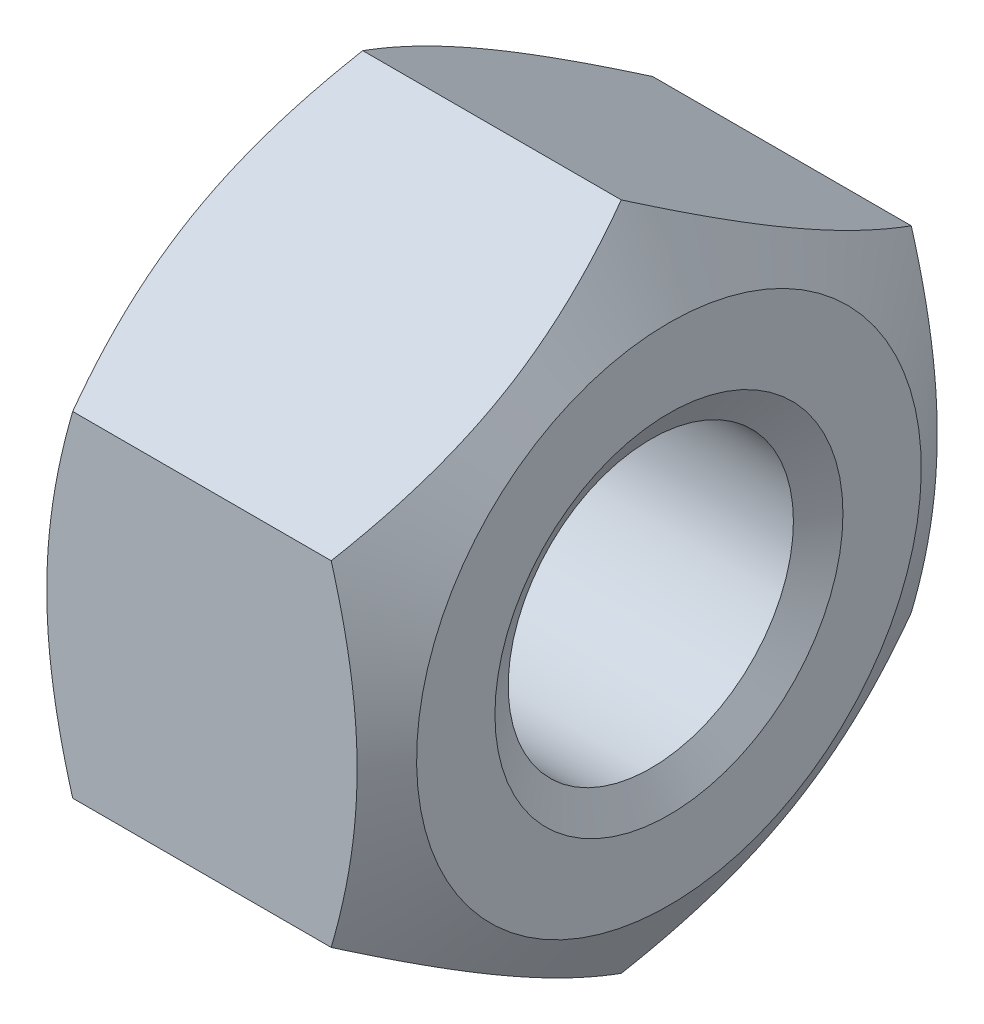
ISO-10303-21;
HEADER;
FILE_DESCRIPTION(('STEP AP214'),'2;1');
FILE_NAME('part.step','',(''),(''),'','','');
FILE_SCHEMA(('AUTOMOTIVE_DESIGN { 1 0 10303 214 1 1 1 1 }'));
ENDSEC;
DATA;
#1=APPLICATION_CONTEXT('core data for automotive mechanical design processes');
#2=APPLICATION_PROTOCOL_DEFINITION('international standard','automotive_design',2000,#1);
#3=PRODUCT_CONTEXT('',#1,'mechanical');
#4=PRODUCT('Part','Part','',(#3));
#5=PRODUCT_RELATED_PRODUCT_CATEGORY('part','',(#4));
#6=PRODUCT_DEFINITION_FORMATION('','',#4);
#7=PRODUCT_DEFINITION_CONTEXT('part definition',#1,'design');
#8=PRODUCT_DEFINITION('design','',#6,#7);
#9=PRODUCT_DEFINITION_SHAPE('','',#8);
#10=(LENGTH_UNIT() NAMED_UNIT(*) SI_UNIT(.MILLI.,.METRE.));
#11=(NAMED_UNIT(*) PLANE_ANGLE_UNIT() SI_UNIT($,.RADIAN.));
#12=(NAMED_UNIT(*) SI_UNIT($,.STERADIAN.) SOLID_ANGLE_UNIT());
#13=UNCERTAINTY_MEASURE_WITH_UNIT(LENGTH_MEASURE(1.E-05),#10,'distance_accuracy_value','');
#14=(GEOMETRIC_REPRESENTATION_CONTEXT(3) GLOBAL_UNCERTAINTY_ASSIGNED_CONTEXT((#13)) GLOBAL_UNIT_ASSIGNED_CONTEXT((#10,
#11,#12)) REPRESENTATION_CONTEXT('',''));
#15=CARTESIAN_POINT('',(0.,0.,0.));
#16=DIRECTION('',(0.,0.,1.));
#17=DIRECTION('',(1.,0.,0.));
#18=AXIS2_PLACEMENT_3D('',#15,#16,#17);
#19=CARTESIAN_POINT('',(0.,-5.77350269189626,0.));
#20=DIRECTION('',(0.,-0.866025403784439,0.5));
#21=DIRECTION('',(-1.,0.,0.));
#22=AXIS2_PLACEMENT_3D('',#19,#20,#21);
#23=PLANE('',#22);
#24=CARTESIAN_POINT('',(0.82185966235846,-2.88675134594813,5.));
#25=CARTESIAN_POINT('',(-0.0114736709748725,-4.3301270189222,2.5));
#26=CARTESIAN_POINT('',(0.821859662358461,-5.77350269189626,0.));
#27=(BOUNDED_CURVE() B_SPLINE_CURVE(2,(#24,#25,#26),.UNSPECIFIED.,.F.,
.F.) B_SPLINE_CURVE_WITH_KNOTS((3,3),(0.,0.584218069038959),
.UNSPECIFIED.) CURVE() GEOMETRIC_REPRESENTATION_ITEM() RATIONAL_B_SPLINE_CURVE((1.,
1.15470053837925,1.)) REPRESENTATION_ITEM(''));
#28=CARTESIAN_POINT('',(0.82185966235846,-2.88675134594813,5.));
#29=VERTEX_POINT('',#28);
#30=CARTESIAN_POINT('',(0.82185966235846,-5.77350269189626,0.));
#31=VERTEX_POINT('',#30);
#32=EDGE_CURVE('E123',#29,#31,#27,.T.);
#33=ORIENTED_EDGE('',*,*,#32,.T.);
#34=DIRECTION('',(1.,0.,0.));
#35=VECTOR('',#34,1.);
#36=CARTESIAN_POINT('',(0.,-5.77350269189626,0.));
#37=LINE('',#36,#35);
#38=CARTESIAN_POINT('',(5.27814033764154,-5.77350269189626,0.));
#39=VERTEX_POINT('',#38);
#40=EDGE_CURVE('E11',#31,#39,#37,.T.);
#41=ORIENTED_EDGE('',*,*,#40,.T.);
#42=CARTESIAN_POINT('',(5.27814033764154,-5.77350269189626,0.));
#43=CARTESIAN_POINT('',(6.11147367097487,-4.3301270189222,2.5));
#44=CARTESIAN_POINT('',(5.27814033764154,-2.88675134594813,5.));
#45=(BOUNDED_CURVE() B_SPLINE_CURVE(2,(#42,#43,#44),.UNSPECIFIED.,.F.,
.F.) B_SPLINE_CURVE_WITH_KNOTS((3,3),(0.,0.584218069038959),
.UNSPECIFIED.) CURVE() GEOMETRIC_REPRESENTATION_ITEM() RATIONAL_B_SPLINE_CURVE((1.,
1.15470053837925,1.)) REPRESENTATION_ITEM(''));
#46=CARTESIAN_POINT('',(5.27814033764154,-2.88675134594813,5.));
#47=VERTEX_POINT('',#46);
#48=EDGE_CURVE('E188',#39,#47,#45,.T.);
#49=ORIENTED_EDGE('',*,*,#48,.T.);
#50=DIRECTION('',(1.,0.,0.));
#51=VECTOR('',#50,1.);
#52=CARTESIAN_POINT('',(0.,-2.88675134594813,5.));
#53=LINE('',#52,#51);
#54=EDGE_CURVE('E29',#29,#47,#53,.T.);
#55=ORIENTED_EDGE('',*,*,#54,.F.);
#56=EDGE_LOOP('',(#33,#41,#49,#55));
#57=FACE_BOUND('',#56,.T.);
#58=ADVANCED_FACE('F16',(#57),#23,.T.);
#59=CARTESIAN_POINT('',(0.,-2.88675134594811,-5.));
#60=DIRECTION('',(0.,-0.866025403784438,-0.5));
#61=DIRECTION('',(0.,0.5,-0.866025403784438));
#62=AXIS2_PLACEMENT_3D('',#59,#60,#61);
#63=PLANE('',#62);
#64=CARTESIAN_POINT('',(0.821859662358461,-5.77350269189626,0.));
#65=CARTESIAN_POINT('',(-0.0114736709748756,-4.3301270189222,-2.5));
#66=CARTESIAN_POINT('',(0.82185966235846,-2.88675134594812,-5.));
#67=(BOUNDED_CURVE() B_SPLINE_CURVE(2,(#64,#65,#66),.UNSPECIFIED.,.F.,
.F.) B_SPLINE_CURVE_WITH_KNOTS((3,3),(0.,0.58421806903896),
.UNSPECIFIED.) CURVE() GEOMETRIC_REPRESENTATION_ITEM() RATIONAL_B_SPLINE_CURVE((1.,
1.15470053837925,1.)) REPRESENTATION_ITEM(''));
#68=CARTESIAN_POINT('',(0.82185966235846,-2.88675134594811,-5.));
#69=VERTEX_POINT('',#68);
#70=EDGE_CURVE('E117',#31,#69,#67,.T.);
#71=ORIENTED_EDGE('',*,*,#70,.T.);
#72=DIRECTION('',(1.,0.,0.));
#73=VECTOR('',#72,1.);
#74=CARTESIAN_POINT('',(0.,-2.88675134594811,-5.));
#75=LINE('',#74,#73);
#76=CARTESIAN_POINT('',(5.27814033764154,-2.88675134594811,-5.));
#77=VERTEX_POINT('',#76);
#78=EDGE_CURVE('E102',#69,#77,#75,.T.);
#79=ORIENTED_EDGE('',*,*,#78,.T.);
#80=CARTESIAN_POINT('',(5.27814033764154,-2.88675134594812,-5.));
#81=CARTESIAN_POINT('',(6.11147367097488,-4.3301270189222,-2.5));
#82=CARTESIAN_POINT('',(5.27814033764154,-5.77350269189626,0.));
#83=(BOUNDED_CURVE() B_SPLINE_CURVE(2,(#80,#81,#82),.UNSPECIFIED.,.F.,
.F.) B_SPLINE_CURVE_WITH_KNOTS((3,3),(0.,0.58421806903896),
.UNSPECIFIED.) CURVE() GEOMETRIC_REPRESENTATION_ITEM() RATIONAL_B_SPLINE_CURVE((1.,
1.15470053837925,1.)) REPRESENTATION_ITEM(''));
#84=EDGE_CURVE('E20',#77,#39,#83,.T.);
#85=ORIENTED_EDGE('',*,*,#84,.T.);
#86=ORIENTED_EDGE('',*,*,#40,.F.);
#87=EDGE_LOOP('',(#71,#79,#85,#86));
#88=FACE_BOUND('',#87,.T.);
#89=ADVANCED_FACE('F118',(#88),#63,.T.);
#90=CARTESIAN_POINT('',(0.,-2.88675134594813,5.));
#91=DIRECTION('',(0.,0.,1.));
#92=DIRECTION('',(1.,0.,0.));
#93=AXIS2_PLACEMENT_3D('',#90,#91,#92);
#94=PLANE('',#93);
#95=CARTESIAN_POINT('',(0.821859662358461,2.88675134594813,5.));
#96=CARTESIAN_POINT('',(-0.0114736709748735,0.,5.));
#97=CARTESIAN_POINT('',(0.821859662358461,-2.88675134594813,5.));
#98=(BOUNDED_CURVE() B_SPLINE_CURVE(2,(#95,#96,#97),.UNSPECIFIED.,.F.,
.F.) B_SPLINE_CURVE_WITH_KNOTS((3,3),(0.,0.58421806903896),
.UNSPECIFIED.) CURVE() GEOMETRIC_REPRESENTATION_ITEM() RATIONAL_B_SPLINE_CURVE((1.,
1.15470053837925,1.)) REPRESENTATION_ITEM(''));
#99=CARTESIAN_POINT('',(0.82185966235846,2.88675134594813,5.));
#100=VERTEX_POINT('',#99);
#101=EDGE_CURVE('E141',#100,#29,#98,.T.);
#102=ORIENTED_EDGE('',*,*,#101,.T.);
#103=ORIENTED_EDGE('',*,*,#54,.T.);
#104=CARTESIAN_POINT('',(5.27814033764154,-2.88675134594813,5.));
#105=CARTESIAN_POINT('',(6.11147367097487,0.,5.));
#106=CARTESIAN_POINT('',(5.27814033764154,2.88675134594813,5.));
#107=(BOUNDED_CURVE() B_SPLINE_CURVE(2,(#104,#105,#106),.UNSPECIFIED.,.F.,
.F.) B_SPLINE_CURVE_WITH_KNOTS((3,3),(0.,0.58421806903896),
.UNSPECIFIED.) CURVE() GEOMETRIC_REPRESENTATION_ITEM() RATIONAL_B_SPLINE_CURVE((1.,
1.15470053837925,1.)) REPRESENTATION_ITEM(''));
#108=CARTESIAN_POINT('',(5.27814033764154,2.88675134594813,5.));
#109=VERTEX_POINT('',#108);
#110=EDGE_CURVE('E180',#47,#109,#107,.T.);
#111=ORIENTED_EDGE('',*,*,#110,.T.);
#112=DIRECTION('',(1.,0.,0.));
#113=VECTOR('',#112,1.);
#114=CARTESIAN_POINT('',(0.,2.88675134594813,5.));
#115=LINE('',#114,#113);
#116=EDGE_CURVE('E114',#100,#109,#115,.T.);
#117=ORIENTED_EDGE('',*,*,#116,.F.);
#118=EDGE_LOOP('',(#102,#103,#111,#117));
#119=FACE_BOUND('',#118,.T.);
#120=ADVANCED_FACE('F271',(#119),#94,.T.);
#121=CARTESIAN_POINT('',(0.,2.88675134594813,5.));
#122=DIRECTION('',(0.,0.866025403784439,0.5));
#123=DIRECTION('',(1.,0.,0.));
#124=AXIS2_PLACEMENT_3D('',#121,#122,#123);
#125=PLANE('',#124);
#126=CARTESIAN_POINT('',(0.821859662358461,5.77350269189626,0.));
#127=CARTESIAN_POINT('',(-0.0114736709748724,4.3301270189222,2.5));
#128=CARTESIAN_POINT('',(0.82185966235846,2.88675134594813,5.));
#129=(BOUNDED_CURVE() B_SPLINE_CURVE(2,(#126,#127,#128),.UNSPECIFIED.,.F.,
.F.) B_SPLINE_CURVE_WITH_KNOTS((3,3),(0.,0.584218069038959),
.UNSPECIFIED.) CURVE() GEOMETRIC_REPRESENTATION_ITEM() RATIONAL_B_SPLINE_CURVE((1.,
1.15470053837925,1.)) REPRESENTATION_ITEM(''));
#130=CARTESIAN_POINT('',(0.82185966235846,5.77350269189626,0.));
#131=VERTEX_POINT('',#130);
#132=EDGE_CURVE('E136',#131,#100,#129,.T.);
#133=ORIENTED_EDGE('',*,*,#132,.T.);
#134=ORIENTED_EDGE('',*,*,#116,.T.);
#135=CARTESIAN_POINT('',(5.27814033764154,2.88675134594813,5.));
#136=CARTESIAN_POINT('',(6.11147367097487,4.3301270189222,2.5));
#137=CARTESIAN_POINT('',(5.27814033764154,5.77350269189626,0.));
#138=(BOUNDED_CURVE() B_SPLINE_CURVE(2,(#135,#136,#137),.UNSPECIFIED.,.F.,
.F.) B_SPLINE_CURVE_WITH_KNOTS((3,3),(0.,0.584218069038959),
.UNSPECIFIED.) CURVE() GEOMETRIC_REPRESENTATION_ITEM() RATIONAL_B_SPLINE_CURVE((1.,
1.15470053837925,1.)) REPRESENTATION_ITEM(''));
#139=CARTESIAN_POINT('',(5.27814033764154,5.77350269189626,0.));
#140=VERTEX_POINT('',#139);
#141=EDGE_CURVE('E179',#109,#140,#138,.T.);
#142=ORIENTED_EDGE('',*,*,#141,.T.);
#143=DIRECTION('',(1.,0.,0.));
#144=VECTOR('',#143,1.);
#145=CARTESIAN_POINT('',(0.,5.77350269189626,0.));
#146=LINE('',#145,#144);
#147=EDGE_CURVE('E221',#131,#140,#146,.T.);
#148=ORIENTED_EDGE('',*,*,#147,.F.);
#149=EDGE_LOOP('',(#133,#134,#142,#148));
#150=FACE_BOUND('',#149,.T.);
#151=ADVANCED_FACE('F401',(#150),#125,.T.);
#152=CARTESIAN_POINT('',(0.,2.88675134594814,-5.));
#153=DIRECTION('',(0.,0.,-1.));
#154=DIRECTION('',(-1.,0.,0.));
#155=AXIS2_PLACEMENT_3D('',#152,#153,#154);
#156=PLANE('',#155);
#157=CARTESIAN_POINT('',(0.82185966235846,-2.88675134594811,-5.));
#158=CARTESIAN_POINT('',(-0.0114736709748668,0.,-5.00000000000001));
#159=CARTESIAN_POINT('',(0.82185966235846,2.88675134594813,-5.));
#160=(BOUNDED_CURVE() B_SPLINE_CURVE(2,(#157,#158,#159),.UNSPECIFIED.,.F.,
.F.) B_SPLINE_CURVE_WITH_KNOTS((3,3),(0.,0.584218069038957),
.UNSPECIFIED.) CURVE() GEOMETRIC_REPRESENTATION_ITEM() RATIONAL_B_SPLINE_CURVE((1.,
1.15470053837925,1.)) REPRESENTATION_ITEM(''));
#161=CARTESIAN_POINT('',(0.82185966235846,2.88675134594814,-5.));
#162=VERTEX_POINT('',#161);
#163=EDGE_CURVE('E106',#69,#162,#160,.T.);
#164=ORIENTED_EDGE('',*,*,#163,.T.);
#165=DIRECTION('',(1.,0.,0.));
#166=VECTOR('',#165,1.);
#167=CARTESIAN_POINT('',(0.,2.88675134594814,-5.));
#168=LINE('',#167,#166);
#169=CARTESIAN_POINT('',(5.27814033764154,2.88675134594814,-5.));
#170=VERTEX_POINT('',#169);
#171=EDGE_CURVE('E43',#162,#170,#168,.T.);
#172=ORIENTED_EDGE('',*,*,#171,.T.);
#173=CARTESIAN_POINT('',(5.27814033764154,2.88675134594813,-5.));
#174=CARTESIAN_POINT('',(6.11147367097487,0.,-5.00000000000001));
#175=CARTESIAN_POINT('',(5.27814033764154,-2.88675134594811,-5.));
#176=(BOUNDED_CURVE() B_SPLINE_CURVE(2,(#173,#174,#175),.UNSPECIFIED.,.F.,
.F.) B_SPLINE_CURVE_WITH_KNOTS((3,3),(0.,0.584218069038958),
.UNSPECIFIED.) CURVE() GEOMETRIC_REPRESENTATION_ITEM() RATIONAL_B_SPLINE_CURVE((1.,
1.15470053837925,1.)) REPRESENTATION_ITEM(''));
#177=EDGE_CURVE('E109',#170,#77,#176,.T.);
#178=ORIENTED_EDGE('',*,*,#177,.T.);
#179=ORIENTED_EDGE('',*,*,#78,.F.);
#180=EDGE_LOOP('',(#164,#172,#178,#179));
#181=FACE_BOUND('',#180,.T.);
#182=ADVANCED_FACE('F104',(#181),#156,.T.);
#183=CARTESIAN_POINT('',(0.,5.77350269189626,0.));
#184=DIRECTION('',(0.,0.866025403784439,-0.5));
#185=DIRECTION('',(-1.,0.,0.));
#186=AXIS2_PLACEMENT_3D('',#183,#184,#185);
#187=PLANE('',#186);
#188=CARTESIAN_POINT('',(0.821859662358461,2.88675134594814,-5.));
#189=CARTESIAN_POINT('',(-0.011473670974869,4.3301270189222,-2.5));
#190=CARTESIAN_POINT('',(0.821859662358461,5.77350269189626,0.));
#191=(BOUNDED_CURVE() B_SPLINE_CURVE(2,(#188,#189,#190),.UNSPECIFIED.,.F.,
.F.) B_SPLINE_CURVE_WITH_KNOTS((3,3),(0.,0.584218069038958),
.UNSPECIFIED.) CURVE() GEOMETRIC_REPRESENTATION_ITEM() RATIONAL_B_SPLINE_CURVE((1.,
1.15470053837925,1.)) REPRESENTATION_ITEM(''));
#192=EDGE_CURVE('E129',#162,#131,#191,.T.);
#193=ORIENTED_EDGE('',*,*,#192,.T.);
#194=ORIENTED_EDGE('',*,*,#147,.T.);
#195=CARTESIAN_POINT('',(5.27814033764154,5.77350269189626,0.));
#196=CARTESIAN_POINT('',(6.11147367097487,4.3301270189222,-2.5));
#197=CARTESIAN_POINT('',(5.27814033764154,2.88675134594814,-5.));
#198=(BOUNDED_CURVE() B_SPLINE_CURVE(2,(#195,#196,#197),.UNSPECIFIED.,.F.,
.F.) B_SPLINE_CURVE_WITH_KNOTS((3,3),(0.,0.584218069038958),
.UNSPECIFIED.) CURVE() GEOMETRIC_REPRESENTATION_ITEM() RATIONAL_B_SPLINE_CURVE((1.,
1.15470053837925,1.)) REPRESENTATION_ITEM(''));
#199=EDGE_CURVE('E225',#140,#170,#198,.T.);
#200=ORIENTED_EDGE('',*,*,#199,.T.);
#201=ORIENTED_EDGE('',*,*,#171,.F.);
#202=EDGE_LOOP('',(#193,#194,#200,#201));
#203=FACE_BOUND('',#202,.T.);
#204=ADVANCED_FACE('F18',(#203),#187,.T.);
#205=CARTESIAN_POINT('',(5.68907016882077,0.,0.));
#206=DIRECTION('',(-1.,0.,0.));
#207=DIRECTION('',(0.,1.,0.));
#208=AXIS2_PLACEMENT_3D('',#205,#206,#207);
#209=CONICAL_SURFACE('',#208,5.06175134594813,1.0471975512);
#210=CARTESIAN_POINT('',(6.1,0.,0.));
#211=DIRECTION('',(1.,0.,0.));
#212=DIRECTION('',(0.,1.,0.));
#213=AXIS2_PLACEMENT_3D('',#210,#211,#212);
#214=CIRCLE('',#213,4.35);
#215=CARTESIAN_POINT('',(6.1,4.35,0.));
#216=VERTEX_POINT('',#215);
#217=EDGE_CURVE('E167',#216,#216,#214,.T.);
#218=ORIENTED_EDGE('',*,*,#217,.F.);
#219=EDGE_LOOP('',(#218));
#220=FACE_BOUND('',#219,.T.);
#221=ORIENTED_EDGE('',*,*,#141,.F.);
#222=ORIENTED_EDGE('',*,*,#110,.F.);
#223=ORIENTED_EDGE('',*,*,#48,.F.);
#224=ORIENTED_EDGE('',*,*,#84,.F.);
#225=ORIENTED_EDGE('',*,*,#177,.F.);
#226=ORIENTED_EDGE('',*,*,#199,.F.);
#227=EDGE_LOOP('',(#221,#222,#223,#224,#225,#226));
#228=FACE_BOUND('',#227,.T.);
#229=ADVANCED_FACE('F265',(#220,#228),#209,.T.);
#230=CARTESIAN_POINT('',(0.41092983117923,0.,0.));
#231=DIRECTION('',(1.,0.,0.));
#232=DIRECTION('',(0.,1.,0.));
#233=AXIS2_PLACEMENT_3D('',#230,#231,#232);
#234=CONICAL_SURFACE('',#233,5.06175134594813,1.0471975512);
#235=CARTESIAN_POINT('',(0.,0.,0.));
#236=DIRECTION('',(-1.,0.,0.));
#237=DIRECTION('',(0.,1.,0.));
#238=AXIS2_PLACEMENT_3D('',#235,#236,#237);
#239=CIRCLE('',#238,4.35);
#240=CARTESIAN_POINT('',(0.,4.35,0.));
#241=VERTEX_POINT('',#240);
#242=EDGE_CURVE('E152',#241,#241,#239,.T.);
#243=ORIENTED_EDGE('',*,*,#242,.F.);
#244=EDGE_LOOP('',(#243));
#245=FACE_BOUND('',#244,.T.);
#246=ORIENTED_EDGE('',*,*,#101,.F.);
#247=ORIENTED_EDGE('',*,*,#132,.F.);
#248=ORIENTED_EDGE('',*,*,#192,.F.);
#249=ORIENTED_EDGE('',*,*,#163,.F.);
#250=ORIENTED_EDGE('',*,*,#70,.F.);
#251=ORIENTED_EDGE('',*,*,#32,.F.);
#252=EDGE_LOOP('',(#246,#247,#248,#249,#250,#251));
#253=FACE_BOUND('',#252,.T.);
#254=ADVANCED_FACE('F126',(#245,#253),#234,.T.);
#255=CARTESIAN_POINT('',(6.1,0.,0.));
#256=DIRECTION('',(1.,0.,0.));
#257=DIRECTION('',(0.,1.,0.));
#258=AXIS2_PLACEMENT_3D('',#255,#256,#257);
#259=PLANE('',#258);
#260=CARTESIAN_POINT('',(6.1,0.,0.));
#261=DIRECTION('',(1.,0.,0.));
#262=DIRECTION('',(0.,0.,1.));
#263=AXIS2_PLACEMENT_3D('',#260,#261,#262);
#264=CIRCLE('',#263,2.99976587736527);
#265=CARTESIAN_POINT('',(6.1,0.,-2.99976587736527));
#266=VERTEX_POINT('',#265);
#267=EDGE_CURVE('E156',#266,#266,#264,.T.);
#268=ORIENTED_EDGE('',*,*,#267,.F.);
#269=EDGE_LOOP('',(#268));
#270=FACE_BOUND('',#269,.T.);
#271=ORIENTED_EDGE('',*,*,#217,.T.);
#272=EDGE_LOOP('',(#271));
#273=FACE_BOUND('',#272,.T.);
#274=ADVANCED_FACE('F350',(#270,#273),#259,.T.);
#275=CARTESIAN_POINT('',(5.94375,0.,0.));
#276=DIRECTION('',(1.,0.,0.));
#277=DIRECTION('',(0.,0.,1.));
#278=AXIS2_PLACEMENT_3D('',#275,#276,#277);
#279=CONICAL_SURFACE('',#278,2.72913293868264,1.0471975512);
#280=ORIENTED_EDGE('',*,*,#267,.T.);
#281=EDGE_LOOP('',(#280));
#282=FACE_BOUND('',#281,.T.);
#283=CARTESIAN_POINT('',(5.7875,0.,0.));
#284=DIRECTION('',(-1.,0.,0.));
#285=DIRECTION('',(0.,0.,1.));
#286=AXIS2_PLACEMENT_3D('',#283,#284,#285);
#287=CIRCLE('',#286,2.4585);
#288=CARTESIAN_POINT('',(5.7875,0.,-2.4585));
#289=VERTEX_POINT('',#288);
#290=EDGE_CURVE('E149',#289,#289,#287,.T.);
#291=ORIENTED_EDGE('',*,*,#290,.T.);
#292=EDGE_LOOP('',(#291));
#293=FACE_BOUND('',#292,.T.);
#294=ADVANCED_FACE('F339',(#282,#293),#279,.F.);
#295=CARTESIAN_POINT('',(0.,0.,0.));
#296=DIRECTION('',(1.,0.,0.));
#297=DIRECTION('',(0.,1.,0.));
#298=AXIS2_PLACEMENT_3D('',#295,#296,#297);
#299=PLANE('',#298);
#300=CARTESIAN_POINT('',(0.,0.,0.));
#301=DIRECTION('',(-1.,0.,0.));
#302=DIRECTION('',(0.,0.,-1.));
#303=AXIS2_PLACEMENT_3D('',#300,#301,#302);
#304=CIRCLE('',#303,2.99976587736527);
#305=CARTESIAN_POINT('',(0.,0.,2.99976587736527));
#306=VERTEX_POINT('',#305);
#307=EDGE_CURVE('E153',#306,#306,#304,.T.);
#308=ORIENTED_EDGE('',*,*,#307,.F.);
#309=EDGE_LOOP('',(#308));
#310=FACE_BOUND('',#309,.T.);
#311=ORIENTED_EDGE('',*,*,#242,.T.);
#312=EDGE_LOOP('',(#311));
#313=FACE_BOUND('',#312,.T.);
#314=ADVANCED_FACE('F328',(#310,#313),#299,.F.);
#315=CARTESIAN_POINT('',(-10.3567256003624,0.,0.));
#316=DIRECTION('',(1.,0.,0.));
#317=DIRECTION('',(0.,0.,-1.));
#318=AXIS2_PLACEMENT_3D('',#315,#316,#317);
#319=CYLINDRICAL_SURFACE('',#318,2.4585);
#320=CARTESIAN_POINT('',(0.3125,0.,0.));
#321=DIRECTION('',(1.,0.,0.));
#322=DIRECTION('',(0.,0.,-1.));
#323=AXIS2_PLACEMENT_3D('',#320,#321,#322);
#324=CIRCLE('',#323,2.4585);
#325=CARTESIAN_POINT('',(0.3125,0.,2.4585));
#326=VERTEX_POINT('',#325);
#327=EDGE_CURVE('E241',#326,#326,#324,.T.);
#328=ORIENTED_EDGE('',*,*,#327,.F.);
#329=EDGE_LOOP('',(#328));
#330=FACE_BOUND('',#329,.T.);
#331=ORIENTED_EDGE('',*,*,#290,.F.);
#332=EDGE_LOOP('',(#331));
#333=FACE_BOUND('',#332,.T.);
#334=ADVANCED_FACE('F315',(#330,#333),#319,.F.);
#335=CARTESIAN_POINT('',(0.15625,0.,0.));
#336=DIRECTION('',(-1.,0.,0.));
#337=DIRECTION('',(0.,0.,-1.));
#338=AXIS2_PLACEMENT_3D('',#335,#336,#337);
#339=CONICAL_SURFACE('',#338,2.72913293868264,1.0471975512);
#340=ORIENTED_EDGE('',*,*,#307,.T.);
#341=EDGE_LOOP('',(#340));
#342=FACE_BOUND('',#341,.T.);
#343=ORIENTED_EDGE('',*,*,#327,.T.);
#344=EDGE_LOOP('',(#343));
#345=FACE_BOUND('',#344,.T.);
#346=ADVANCED_FACE('F309',(#342,#345),#339,.F.);
#347=CLOSED_SHELL('',(#58,#89,#120,#151,#182,#204,#229,#254,#274,#294,#314,#334,#346));
#348=MANIFOLD_SOLID_BREP('B1',#347);
#349=ADVANCED_BREP_SHAPE_REPRESENTATION('',(#18,#348),#14);
#350=SHAPE_DEFINITION_REPRESENTATION(#9,#349);
ENDSEC;
END-ISO-10303-21;
